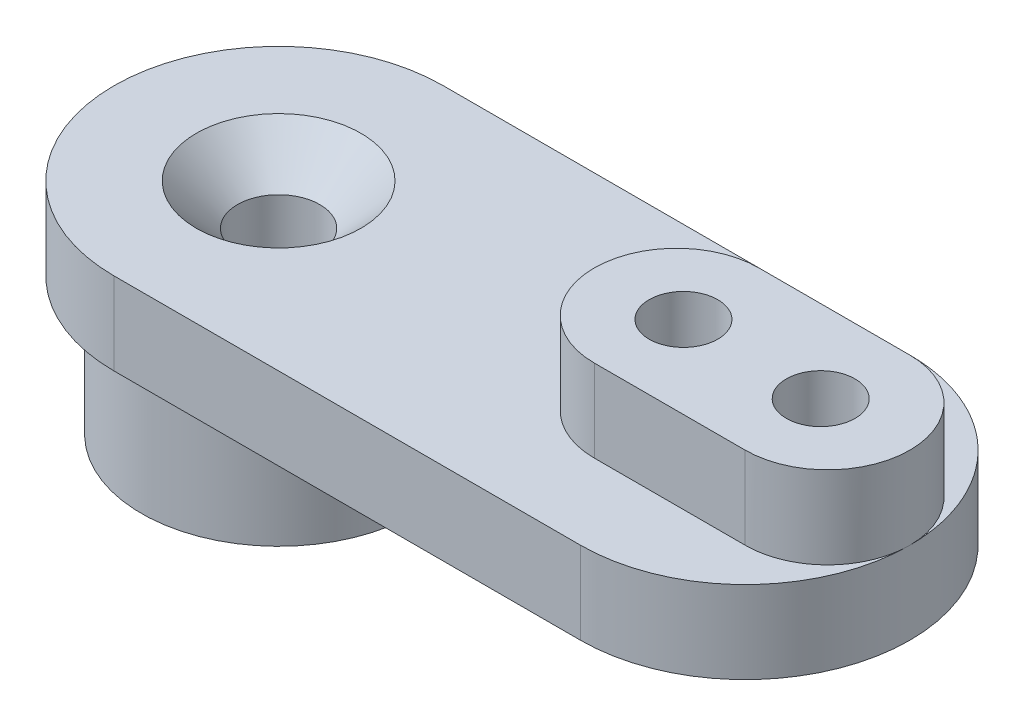
ISO-10303-21;
HEADER;
FILE_DESCRIPTION(('STEP AP214'),'2;1');
FILE_NAME('part.step','',(''),(''),'','','');
FILE_SCHEMA(('AUTOMOTIVE_DESIGN { 1 0 10303 214 1 1 1 1 }'));
ENDSEC;
DATA;
#1=APPLICATION_CONTEXT('core data for automotive mechanical design processes');
#2=APPLICATION_PROTOCOL_DEFINITION('international standard','automotive_design',2000,#1);
#3=PRODUCT_CONTEXT('',#1,'mechanical');
#4=PRODUCT('Part','Part','',(#3));
#5=PRODUCT_RELATED_PRODUCT_CATEGORY('part','',(#4));
#6=PRODUCT_DEFINITION_FORMATION('','',#4);
#7=PRODUCT_DEFINITION_CONTEXT('part definition',#1,'design');
#8=PRODUCT_DEFINITION('design','',#6,#7);
#9=PRODUCT_DEFINITION_SHAPE('','',#8);
#10=(LENGTH_UNIT() NAMED_UNIT(*) SI_UNIT(.MILLI.,.METRE.));
#11=(NAMED_UNIT(*) PLANE_ANGLE_UNIT() SI_UNIT($,.RADIAN.));
#12=(NAMED_UNIT(*) SI_UNIT($,.STERADIAN.) SOLID_ANGLE_UNIT());
#13=UNCERTAINTY_MEASURE_WITH_UNIT(LENGTH_MEASURE(1.E-05),#10,'distance_accuracy_value','');
#14=(GEOMETRIC_REPRESENTATION_CONTEXT(3) GLOBAL_UNCERTAINTY_ASSIGNED_CONTEXT((#13)) GLOBAL_UNIT_ASSIGNED_CONTEXT((#10,
#11,#12)) REPRESENTATION_CONTEXT('',''));
#15=CARTESIAN_POINT('',(0.,0.,0.));
#16=DIRECTION('',(0.,0.,1.));
#17=DIRECTION('',(1.,0.,0.));
#18=AXIS2_PLACEMENT_3D('',#15,#16,#17);
#19=CARTESIAN_POINT('',(-8.5,3.,0.));
#20=DIRECTION('',(0.,1.,0.));
#21=DIRECTION('',(0.,0.,1.));
#22=AXIS2_PLACEMENT_3D('',#19,#20,#21);
#23=PLANE('',#22);
#24=CARTESIAN_POINT('',(-8.5,3.,0.));
#25=DIRECTION('',(0.,1.,0.));
#26=DIRECTION('',(0.,0.,1.));
#27=AXIS2_PLACEMENT_3D('',#24,#25,#26);
#28=CIRCLE('',#27,3.);
#29=CARTESIAN_POINT('',(-8.5,3.,3.));
#30=VERTEX_POINT('',#29);
#31=EDGE_CURVE('E11',#30,#30,#28,.F.);
#32=ORIENTED_EDGE('',*,*,#31,.T.);
#33=EDGE_LOOP('',(#32));
#34=FACE_BOUND('',#33,.T.);
#35=DIRECTION('',(-1.,0.,0.));
#36=VECTOR('',#35,1.);
#37=CARTESIAN_POINT('',(6.,3.,-3.));
#38=LINE('',#37,#36);
#39=CARTESIAN_POINT('',(11.5,3.,-3.));
#40=VERTEX_POINT('',#39);
#41=CARTESIAN_POINT('',(6.,3.,-3.));
#42=VERTEX_POINT('',#41);
#43=EDGE_CURVE('E47',#40,#42,#38,.T.);
#44=ORIENTED_EDGE('',*,*,#43,.F.);
#45=CARTESIAN_POINT('',(11.5,3.,0.));
#46=DIRECTION('',(0.,1.,0.));
#47=DIRECTION('',(0.,0.,1.));
#48=AXIS2_PLACEMENT_3D('',#45,#46,#47);
#49=CIRCLE('',#48,3.);
#50=CARTESIAN_POINT('',(14.5,3.,0.));
#51=VERTEX_POINT('',#50);
#52=EDGE_CURVE('E164',#51,#40,#49,.T.);
#53=ORIENTED_EDGE('',*,*,#52,.F.);
#54=CARTESIAN_POINT('',(8.5,3.,0.));
#55=DIRECTION('',(0.,1.,0.));
#56=DIRECTION('',(0.,0.,1.));
#57=AXIS2_PLACEMENT_3D('',#54,#55,#56);
#58=CIRCLE('',#57,6.);
#59=CARTESIAN_POINT('',(8.5,3.,-6.));
#60=VERTEX_POINT('',#59);
#61=EDGE_CURVE('E139',#51,#60,#58,.T.);
#62=ORIENTED_EDGE('',*,*,#61,.T.);
#63=DIRECTION('',(-1.,0.,0.));
#64=VECTOR('',#63,1.);
#65=CARTESIAN_POINT('',(-8.5,3.,-6.));
#66=LINE('',#65,#64);
#67=CARTESIAN_POINT('',(-8.5,3.,-6.));
#68=VERTEX_POINT('',#67);
#69=EDGE_CURVE('E143',#60,#68,#66,.T.);
#70=ORIENTED_EDGE('',*,*,#69,.T.);
#71=CARTESIAN_POINT('',(-8.5,3.,0.));
#72=DIRECTION('',(0.,1.,0.));
#73=DIRECTION('',(0.,0.,1.));
#74=AXIS2_PLACEMENT_3D('',#71,#72,#73);
#75=CIRCLE('',#74,6.);
#76=CARTESIAN_POINT('',(-8.5,3.,6.));
#77=VERTEX_POINT('',#76);
#78=EDGE_CURVE('E133',#68,#77,#75,.T.);
#79=ORIENTED_EDGE('',*,*,#78,.T.);
#80=DIRECTION('',(1.,0.,0.));
#81=VECTOR('',#80,1.);
#82=CARTESIAN_POINT('',(-8.5,3.,6.));
#83=LINE('',#82,#81);
#84=CARTESIAN_POINT('',(8.5,3.,6.));
#85=VERTEX_POINT('',#84);
#86=EDGE_CURVE('E136',#77,#85,#83,.T.);
#87=ORIENTED_EDGE('',*,*,#86,.T.);
#88=EDGE_CURVE('E140',#85,#51,#58,.T.);
#89=ORIENTED_EDGE('',*,*,#88,.T.);
#90=CARTESIAN_POINT('',(11.5,3.,3.));
#91=VERTEX_POINT('',#90);
#92=EDGE_CURVE('E226',#91,#51,#49,.T.);
#93=ORIENTED_EDGE('',*,*,#92,.F.);
#94=DIRECTION('',(1.,0.,0.));
#95=VECTOR('',#94,1.);
#96=CARTESIAN_POINT('',(6.,3.,3.));
#97=LINE('',#96,#95);
#98=CARTESIAN_POINT('',(6.,3.,3.));
#99=VERTEX_POINT('',#98);
#100=EDGE_CURVE('E231',#99,#91,#97,.T.);
#101=ORIENTED_EDGE('',*,*,#100,.F.);
#102=CARTESIAN_POINT('',(6.,3.,0.));
#103=DIRECTION('',(0.,1.,0.));
#104=DIRECTION('',(0.,0.,1.));
#105=AXIS2_PLACEMENT_3D('',#102,#103,#104);
#106=CIRCLE('',#105,3.);
#107=EDGE_CURVE('E52',#42,#99,#106,.T.);
#108=ORIENTED_EDGE('',*,*,#107,.F.);
#109=EDGE_LOOP('',(#44,#53,#62,#70,#79,#87,#89,#93,#101,#108));
#110=FACE_BOUND('',#109,.T.);
#111=ADVANCED_FACE('F32',(#34,#110),#23,.T.);
#112=CARTESIAN_POINT('',(-8.5,0.,0.));
#113=DIRECTION('',(0.,1.,0.));
#114=DIRECTION('',(0.,0.,1.));
#115=AXIS2_PLACEMENT_3D('',#112,#113,#114);
#116=PLANE('',#115);
#117=CARTESIAN_POINT('',(-8.5,0.,0.));
#118=DIRECTION('',(0.,-1.,0.));
#119=DIRECTION('',(0.,0.,-1.));
#120=AXIS2_PLACEMENT_3D('',#117,#118,#119);
#121=CIRCLE('',#120,5.);
#122=CARTESIAN_POINT('',(-8.5,0.,-5.));
#123=VERTEX_POINT('',#122);
#124=EDGE_CURVE('E167',#123,#123,#121,.T.);
#125=ORIENTED_EDGE('',*,*,#124,.F.);
#126=EDGE_LOOP('',(#125));
#127=FACE_BOUND('',#126,.T.);
#128=CARTESIAN_POINT('',(-8.5,0.,0.));
#129=DIRECTION('',(0.,1.,0.));
#130=DIRECTION('',(0.,0.,1.));
#131=AXIS2_PLACEMENT_3D('',#128,#129,#130);
#132=CIRCLE('',#131,6.);
#133=CARTESIAN_POINT('',(-8.5,0.,-6.));
#134=VERTEX_POINT('',#133);
#135=CARTESIAN_POINT('',(-8.5,0.,6.));
#136=VERTEX_POINT('',#135);
#137=EDGE_CURVE('E132',#134,#136,#132,.T.);
#138=ORIENTED_EDGE('',*,*,#137,.F.);
#139=DIRECTION('',(-1.,0.,0.));
#140=VECTOR('',#139,1.);
#141=CARTESIAN_POINT('',(-8.5,0.,-6.));
#142=LINE('',#141,#140);
#143=CARTESIAN_POINT('',(8.5,0.,-6.));
#144=VERTEX_POINT('',#143);
#145=EDGE_CURVE('E137',#144,#134,#142,.T.);
#146=ORIENTED_EDGE('',*,*,#145,.F.);
#147=CARTESIAN_POINT('',(8.5,0.,0.));
#148=DIRECTION('',(0.,1.,0.));
#149=DIRECTION('',(0.,0.,1.));
#150=AXIS2_PLACEMENT_3D('',#147,#148,#149);
#151=CIRCLE('',#150,6.);
#152=CARTESIAN_POINT('',(8.5,0.,6.));
#153=VERTEX_POINT('',#152);
#154=EDGE_CURVE('E150',#153,#144,#151,.T.);
#155=ORIENTED_EDGE('',*,*,#154,.F.);
#156=DIRECTION('',(1.,0.,0.));
#157=VECTOR('',#156,1.);
#158=CARTESIAN_POINT('',(-8.5,0.,6.));
#159=LINE('',#158,#157);
#160=EDGE_CURVE('E148',#136,#153,#159,.T.);
#161=ORIENTED_EDGE('',*,*,#160,.F.);
#162=EDGE_LOOP('',(#138,#146,#155,#161));
#163=FACE_BOUND('',#162,.T.);
#164=CARTESIAN_POINT('',(11.25,0.,0.));
#165=DIRECTION('',(0.,1.,0.));
#166=DIRECTION('',(0.,0.,1.));
#167=AXIS2_PLACEMENT_3D('',#164,#165,#166);
#168=CIRCLE('',#167,1.25);
#169=CARTESIAN_POINT('',(11.25,0.,1.25));
#170=VERTEX_POINT('',#169);
#171=EDGE_CURVE('E124',#170,#170,#168,.T.);
#172=ORIENTED_EDGE('',*,*,#171,.T.);
#173=EDGE_LOOP('',(#172));
#174=FACE_BOUND('',#173,.T.);
#175=CARTESIAN_POINT('',(6.25,0.,0.));
#176=DIRECTION('',(0.,1.,0.));
#177=DIRECTION('',(0.,0.,1.));
#178=AXIS2_PLACEMENT_3D('',#175,#176,#177);
#179=CIRCLE('',#178,1.25);
#180=CARTESIAN_POINT('',(6.25,0.,1.25));
#181=VERTEX_POINT('',#180);
#182=EDGE_CURVE('E121',#181,#181,#179,.T.);
#183=ORIENTED_EDGE('',*,*,#182,.T.);
#184=EDGE_LOOP('',(#183));
#185=FACE_BOUND('',#184,.T.);
#186=ADVANCED_FACE('F185',(#127,#163,#174,#185),#116,.F.);
#187=CARTESIAN_POINT('',(-8.5,3.,0.));
#188=DIRECTION('',(0.,-1.,0.));
#189=DIRECTION('',(0.,0.,-1.));
#190=AXIS2_PLACEMENT_3D('',#187,#188,#189);
#191=CYLINDRICAL_SURFACE('',#190,6.);
#192=ORIENTED_EDGE('',*,*,#137,.T.);
#193=DIRECTION('',(0.,-1.,0.));
#194=VECTOR('',#193,1.);
#195=CARTESIAN_POINT('',(-8.5,3.,6.));
#196=LINE('',#195,#194);
#197=EDGE_CURVE('E161',#77,#136,#196,.T.);
#198=ORIENTED_EDGE('',*,*,#197,.F.);
#199=ORIENTED_EDGE('',*,*,#78,.F.);
#200=DIRECTION('',(0.,-1.,0.));
#201=VECTOR('',#200,1.);
#202=CARTESIAN_POINT('',(-8.5,3.,-6.));
#203=LINE('',#202,#201);
#204=EDGE_CURVE('E145',#68,#134,#203,.T.);
#205=ORIENTED_EDGE('',*,*,#204,.T.);
#206=EDGE_LOOP('',(#192,#198,#199,#205));
#207=FACE_BOUND('',#206,.T.);
#208=ADVANCED_FACE('F191',(#207),#191,.T.);
#209=CARTESIAN_POINT('',(-8.5,3.,6.));
#210=DIRECTION('',(0.,0.,-1.));
#211=DIRECTION('',(-1.,0.,0.));
#212=AXIS2_PLACEMENT_3D('',#209,#210,#211);
#213=PLANE('',#212);
#214=ORIENTED_EDGE('',*,*,#160,.T.);
#215=DIRECTION('',(0.,-1.,0.));
#216=VECTOR('',#215,1.);
#217=CARTESIAN_POINT('',(8.5,3.,6.));
#218=LINE('',#217,#216);
#219=EDGE_CURVE('E158',#85,#153,#218,.T.);
#220=ORIENTED_EDGE('',*,*,#219,.F.);
#221=ORIENTED_EDGE('',*,*,#86,.F.);
#222=ORIENTED_EDGE('',*,*,#197,.T.);
#223=EDGE_LOOP('',(#214,#220,#221,#222));
#224=FACE_BOUND('',#223,.T.);
#225=ADVANCED_FACE('F204',(#224),#213,.F.);
#226=CARTESIAN_POINT('',(8.5,3.,0.));
#227=DIRECTION('',(0.,-1.,0.));
#228=DIRECTION('',(0.,0.,-1.));
#229=AXIS2_PLACEMENT_3D('',#226,#227,#228);
#230=CYLINDRICAL_SURFACE('',#229,6.);
#231=ORIENTED_EDGE('',*,*,#154,.T.);
#232=DIRECTION('',(0.,-1.,0.));
#233=VECTOR('',#232,1.);
#234=CARTESIAN_POINT('',(8.5,3.,-6.));
#235=LINE('',#234,#233);
#236=EDGE_CURVE('E155',#60,#144,#235,.T.);
#237=ORIENTED_EDGE('',*,*,#236,.F.);
#238=ORIENTED_EDGE('',*,*,#61,.F.);
#239=ORIENTED_EDGE('',*,*,#88,.F.);
#240=ORIENTED_EDGE('',*,*,#219,.T.);
#241=EDGE_LOOP('',(#231,#237,#238,#239,#240));
#242=FACE_BOUND('',#241,.T.);
#243=ADVANCED_FACE('F200',(#242),#230,.T.);
#244=CARTESIAN_POINT('',(-8.5,3.,-6.));
#245=DIRECTION('',(0.,0.,1.));
#246=DIRECTION('',(1.,0.,0.));
#247=AXIS2_PLACEMENT_3D('',#244,#245,#246);
#248=PLANE('',#247);
#249=ORIENTED_EDGE('',*,*,#145,.T.);
#250=ORIENTED_EDGE('',*,*,#204,.F.);
#251=ORIENTED_EDGE('',*,*,#69,.F.);
#252=ORIENTED_EDGE('',*,*,#236,.T.);
#253=EDGE_LOOP('',(#249,#250,#251,#252));
#254=FACE_BOUND('',#253,.T.);
#255=ADVANCED_FACE('F197',(#254),#248,.F.);
#256=CARTESIAN_POINT('',(-8.5,3.,0.));
#257=DIRECTION('',(0.,-1.,0.));
#258=DIRECTION('',(0.,0.,-1.));
#259=AXIS2_PLACEMENT_3D('',#256,#257,#258);
#260=CYLINDRICAL_SURFACE('',#259,1.5);
#261=CARTESIAN_POINT('',(-8.5,1.5,0.));
#262=DIRECTION('',(0.,1.,0.));
#263=DIRECTION('',(0.,0.,1.));
#264=AXIS2_PLACEMENT_3D('',#261,#262,#263);
#265=CIRCLE('',#264,1.5);
#266=CARTESIAN_POINT('',(-8.5,1.5,1.5));
#267=VERTEX_POINT('',#266);
#268=EDGE_CURVE('E40',#267,#267,#265,.T.);
#269=ORIENTED_EDGE('',*,*,#268,.T.);
#270=EDGE_LOOP('',(#269));
#271=FACE_BOUND('',#270,.T.);
#272=CARTESIAN_POINT('',(-8.5,-1.,0.));
#273=DIRECTION('',(0.,-1.,0.));
#274=DIRECTION('',(0.,0.,-1.));
#275=AXIS2_PLACEMENT_3D('',#272,#273,#274);
#276=CIRCLE('',#275,1.5);
#277=CARTESIAN_POINT('',(-8.5,-1.,-1.5));
#278=VERTEX_POINT('',#277);
#279=EDGE_CURVE('E413',#278,#278,#276,.F.);
#280=ORIENTED_EDGE('',*,*,#279,.F.);
#281=EDGE_LOOP('',(#280));
#282=FACE_BOUND('',#281,.T.);
#283=ADVANCED_FACE('F171',(#271,#282),#260,.F.);
#284=CARTESIAN_POINT('',(11.25,3.,0.));
#285=DIRECTION('',(0.,-1.,0.));
#286=DIRECTION('',(0.,0.,-1.));
#287=AXIS2_PLACEMENT_3D('',#284,#285,#286);
#288=CYLINDRICAL_SURFACE('',#287,1.25);
#289=ORIENTED_EDGE('',*,*,#171,.F.);
#290=EDGE_LOOP('',(#289));
#291=FACE_BOUND('',#290,.T.);
#292=CARTESIAN_POINT('',(11.25,6.,0.));
#293=DIRECTION('',(0.,1.,0.));
#294=DIRECTION('',(0.,0.,1.));
#295=AXIS2_PLACEMENT_3D('',#292,#293,#294);
#296=CIRCLE('',#295,1.25);
#297=CARTESIAN_POINT('',(11.25,6.,1.25));
#298=VERTEX_POINT('',#297);
#299=EDGE_CURVE('E243',#298,#298,#296,.T.);
#300=ORIENTED_EDGE('',*,*,#299,.T.);
#301=EDGE_LOOP('',(#300));
#302=FACE_BOUND('',#301,.T.);
#303=ADVANCED_FACE('F275',(#291,#302),#288,.F.);
#304=CARTESIAN_POINT('',(6.25,3.,0.));
#305=DIRECTION('',(0.,-1.,0.));
#306=DIRECTION('',(0.,0.,-1.));
#307=AXIS2_PLACEMENT_3D('',#304,#305,#306);
#308=CYLINDRICAL_SURFACE('',#307,1.25);
#309=ORIENTED_EDGE('',*,*,#182,.F.);
#310=EDGE_LOOP('',(#309));
#311=FACE_BOUND('',#310,.T.);
#312=CARTESIAN_POINT('',(6.25,6.,0.));
#313=DIRECTION('',(0.,1.,0.));
#314=DIRECTION('',(0.,0.,1.));
#315=AXIS2_PLACEMENT_3D('',#312,#313,#314);
#316=CIRCLE('',#315,1.25);
#317=CARTESIAN_POINT('',(6.25,6.,1.25));
#318=VERTEX_POINT('',#317);
#319=EDGE_CURVE('E246',#318,#318,#316,.T.);
#320=ORIENTED_EDGE('',*,*,#319,.T.);
#321=EDGE_LOOP('',(#320));
#322=FACE_BOUND('',#321,.T.);
#323=ADVANCED_FACE('F273',(#311,#322),#308,.F.);
#324=CARTESIAN_POINT('',(6.,6.,0.));
#325=DIRECTION('',(0.,1.,0.));
#326=DIRECTION('',(0.,0.,1.));
#327=AXIS2_PLACEMENT_3D('',#324,#325,#326);
#328=PLANE('',#327);
#329=ORIENTED_EDGE('',*,*,#319,.F.);
#330=EDGE_LOOP('',(#329));
#331=FACE_BOUND('',#330,.T.);
#332=CARTESIAN_POINT('',(6.,6.,0.));
#333=DIRECTION('',(0.,1.,0.));
#334=DIRECTION('',(0.,0.,1.));
#335=AXIS2_PLACEMENT_3D('',#332,#333,#334);
#336=CIRCLE('',#335,3.);
#337=CARTESIAN_POINT('',(6.,6.,-3.));
#338=VERTEX_POINT('',#337);
#339=CARTESIAN_POINT('',(6.,6.,3.));
#340=VERTEX_POINT('',#339);
#341=EDGE_CURVE('E109',#338,#340,#336,.T.);
#342=ORIENTED_EDGE('',*,*,#341,.T.);
#343=DIRECTION('',(1.,0.,0.));
#344=VECTOR('',#343,1.);
#345=CARTESIAN_POINT('',(6.,6.,3.));
#346=LINE('',#345,#344);
#347=CARTESIAN_POINT('',(11.5,6.,3.));
#348=VERTEX_POINT('',#347);
#349=EDGE_CURVE('E98',#340,#348,#346,.T.);
#350=ORIENTED_EDGE('',*,*,#349,.T.);
#351=CARTESIAN_POINT('',(11.5,6.,0.));
#352=DIRECTION('',(0.,1.,0.));
#353=DIRECTION('',(0.,0.,1.));
#354=AXIS2_PLACEMENT_3D('',#351,#352,#353);
#355=CIRCLE('',#354,3.);
#356=CARTESIAN_POINT('',(11.5,6.,-3.));
#357=VERTEX_POINT('',#356);
#358=EDGE_CURVE('E108',#348,#357,#355,.T.);
#359=ORIENTED_EDGE('',*,*,#358,.T.);
#360=DIRECTION('',(-1.,0.,0.));
#361=VECTOR('',#360,1.);
#362=CARTESIAN_POINT('',(6.,6.,-3.));
#363=LINE('',#362,#361);
#364=EDGE_CURVE('E115',#357,#338,#363,.T.);
#365=ORIENTED_EDGE('',*,*,#364,.T.);
#366=EDGE_LOOP('',(#342,#350,#359,#365));
#367=FACE_BOUND('',#366,.T.);
#368=ORIENTED_EDGE('',*,*,#299,.F.);
#369=EDGE_LOOP('',(#368));
#370=FACE_BOUND('',#369,.T.);
#371=ADVANCED_FACE('F112',(#331,#367,#370),#328,.T.);
#372=CARTESIAN_POINT('',(6.,6.,0.));
#373=DIRECTION('',(0.,-1.,0.));
#374=DIRECTION('',(0.,0.,-1.));
#375=AXIS2_PLACEMENT_3D('',#372,#373,#374);
#376=CYLINDRICAL_SURFACE('',#375,3.);
#377=ORIENTED_EDGE('',*,*,#107,.T.);
#378=DIRECTION('',(0.,-1.,0.));
#379=VECTOR('',#378,1.);
#380=CARTESIAN_POINT('',(6.,6.,3.));
#381=LINE('',#380,#379);
#382=EDGE_CURVE('E103',#340,#99,#381,.T.);
#383=ORIENTED_EDGE('',*,*,#382,.F.);
#384=ORIENTED_EDGE('',*,*,#341,.F.);
#385=DIRECTION('',(0.,-1.,0.));
#386=VECTOR('',#385,1.);
#387=CARTESIAN_POINT('',(6.,6.,-3.));
#388=LINE('',#387,#386);
#389=EDGE_CURVE('E251',#338,#42,#388,.T.);
#390=ORIENTED_EDGE('',*,*,#389,.T.);
#391=EDGE_LOOP('',(#377,#383,#384,#390));
#392=FACE_BOUND('',#391,.T.);
#393=ADVANCED_FACE('F120',(#392),#376,.T.);
#394=CARTESIAN_POINT('',(6.,6.,3.));
#395=DIRECTION('',(0.,0.,-1.));
#396=DIRECTION('',(-1.,0.,0.));
#397=AXIS2_PLACEMENT_3D('',#394,#395,#396);
#398=PLANE('',#397);
#399=ORIENTED_EDGE('',*,*,#100,.T.);
#400=DIRECTION('',(0.,-1.,0.));
#401=VECTOR('',#400,1.);
#402=CARTESIAN_POINT('',(11.5,6.,3.));
#403=LINE('',#402,#401);
#404=EDGE_CURVE('E105',#348,#91,#403,.T.);
#405=ORIENTED_EDGE('',*,*,#404,.F.);
#406=ORIENTED_EDGE('',*,*,#349,.F.);
#407=ORIENTED_EDGE('',*,*,#382,.T.);
#408=EDGE_LOOP('',(#399,#405,#406,#407));
#409=FACE_BOUND('',#408,.T.);
#410=ADVANCED_FACE('F101',(#409),#398,.F.);
#411=CARTESIAN_POINT('',(11.5,6.,0.));
#412=DIRECTION('',(0.,-1.,0.));
#413=DIRECTION('',(0.,0.,-1.));
#414=AXIS2_PLACEMENT_3D('',#411,#412,#413);
#415=CYLINDRICAL_SURFACE('',#414,3.);
#416=ORIENTED_EDGE('',*,*,#92,.T.);
#417=ORIENTED_EDGE('',*,*,#52,.T.);
#418=DIRECTION('',(0.,-1.,0.));
#419=VECTOR('',#418,1.);
#420=CARTESIAN_POINT('',(11.5,6.,-3.));
#421=LINE('',#420,#419);
#422=EDGE_CURVE('E126',#357,#40,#421,.T.);
#423=ORIENTED_EDGE('',*,*,#422,.F.);
#424=ORIENTED_EDGE('',*,*,#358,.F.);
#425=ORIENTED_EDGE('',*,*,#404,.T.);
#426=EDGE_LOOP('',(#416,#417,#423,#424,#425));
#427=FACE_BOUND('',#426,.T.);
#428=ADVANCED_FACE('F228',(#427),#415,.T.);
#429=CARTESIAN_POINT('',(6.,6.,-3.));
#430=DIRECTION('',(0.,0.,1.));
#431=DIRECTION('',(1.,0.,0.));
#432=AXIS2_PLACEMENT_3D('',#429,#430,#431);
#433=PLANE('',#432);
#434=ORIENTED_EDGE('',*,*,#43,.T.);
#435=ORIENTED_EDGE('',*,*,#389,.F.);
#436=ORIENTED_EDGE('',*,*,#364,.F.);
#437=ORIENTED_EDGE('',*,*,#422,.T.);
#438=EDGE_LOOP('',(#434,#435,#436,#437));
#439=FACE_BOUND('',#438,.T.);
#440=ADVANCED_FACE('F254',(#439),#433,.F.);
#441=CARTESIAN_POINT('',(-8.5,-5.,0.));
#442=DIRECTION('',(0.,-1.,0.));
#443=DIRECTION('',(0.,0.,-1.));
#444=AXIS2_PLACEMENT_3D('',#441,#442,#443);
#445=PLANE('',#444);
#446=CARTESIAN_POINT('',(-8.5,-5.,0.));
#447=DIRECTION('',(0.,-1.,0.));
#448=DIRECTION('',(0.,0.,-1.));
#449=AXIS2_PLACEMENT_3D('',#446,#447,#448);
#450=CIRCLE('',#449,5.);
#451=CARTESIAN_POINT('',(-8.5,-5.,-5.));
#452=VERTEX_POINT('',#451);
#453=EDGE_CURVE('E241',#452,#452,#450,.T.);
#454=ORIENTED_EDGE('',*,*,#453,.T.);
#455=EDGE_LOOP('',(#454));
#456=FACE_BOUND('',#455,.T.);
#457=CARTESIAN_POINT('',(-8.5,-5.,0.));
#458=DIRECTION('',(0.,-1.,0.));
#459=DIRECTION('',(0.,0.,-1.));
#460=AXIS2_PLACEMENT_3D('',#457,#458,#459);
#461=CIRCLE('',#460,3.);
#462=CARTESIAN_POINT('',(-8.5,-5.,-3.));
#463=VERTEX_POINT('',#462);
#464=EDGE_CURVE('E411',#463,#463,#461,.T.);
#465=ORIENTED_EDGE('',*,*,#464,.F.);
#466=EDGE_LOOP('',(#465));
#467=FACE_BOUND('',#466,.T.);
#468=ADVANCED_FACE('F256',(#456,#467),#445,.T.);
#469=CARTESIAN_POINT('',(-8.5,-5.,0.));
#470=DIRECTION('',(0.,1.,0.));
#471=DIRECTION('',(0.,0.,1.));
#472=AXIS2_PLACEMENT_3D('',#469,#470,#471);
#473=CYLINDRICAL_SURFACE('',#472,5.);
#474=ORIENTED_EDGE('',*,*,#453,.F.);
#475=EDGE_LOOP('',(#474));
#476=FACE_BOUND('',#475,.T.);
#477=ORIENTED_EDGE('',*,*,#124,.T.);
#478=EDGE_LOOP('',(#477));
#479=FACE_BOUND('',#478,.T.);
#480=ADVANCED_FACE('F262',(#476,#479),#473,.T.);
#481=CARTESIAN_POINT('',(-8.5,-5.,0.));
#482=DIRECTION('',(0.,1.,0.));
#483=DIRECTION('',(0.,0.,1.));
#484=AXIS2_PLACEMENT_3D('',#481,#482,#483);
#485=CYLINDRICAL_SURFACE('',#484,3.);
#486=CARTESIAN_POINT('',(-8.5,-1.,0.));
#487=DIRECTION('',(0.,-1.,0.));
#488=DIRECTION('',(0.,0.,-1.));
#489=AXIS2_PLACEMENT_3D('',#486,#487,#488);
#490=CIRCLE('',#489,3.);
#491=CARTESIAN_POINT('',(-8.5,-1.,-3.));
#492=VERTEX_POINT('',#491);
#493=EDGE_CURVE('E165',#492,#492,#490,.T.);
#494=ORIENTED_EDGE('',*,*,#493,.F.);
#495=EDGE_LOOP('',(#494));
#496=FACE_BOUND('',#495,.T.);
#497=ORIENTED_EDGE('',*,*,#464,.T.);
#498=EDGE_LOOP('',(#497));
#499=FACE_BOUND('',#498,.T.);
#500=ADVANCED_FACE('F180',(#496,#499),#485,.F.);
#501=CARTESIAN_POINT('',(0.,-1.,0.));
#502=DIRECTION('',(0.,-1.,0.));
#503=DIRECTION('',(0.,0.,-1.));
#504=AXIS2_PLACEMENT_3D('',#501,#502,#503);
#505=PLANE('',#504);
#506=ORIENTED_EDGE('',*,*,#279,.T.);
#507=EDGE_LOOP('',(#506));
#508=FACE_BOUND('',#507,.T.);
#509=ORIENTED_EDGE('',*,*,#493,.T.);
#510=EDGE_LOOP('',(#509));
#511=FACE_BOUND('',#510,.T.);
#512=ADVANCED_FACE('F175',(#508,#511),#505,.T.);
#513=CARTESIAN_POINT('',(-8.5,1.5,0.));
#514=DIRECTION('',(0.,1.,0.));
#515=DIRECTION('',(0.,0.,1.));
#516=AXIS2_PLACEMENT_3D('',#513,#514,#515);
#517=CONICAL_SURFACE('',#516,1.5,0.785398163397449);
#518=ORIENTED_EDGE('',*,*,#31,.F.);
#519=EDGE_LOOP('',(#518));
#520=FACE_BOUND('',#519,.T.);
#521=ORIENTED_EDGE('',*,*,#268,.F.);
#522=EDGE_LOOP('',(#521));
#523=FACE_BOUND('',#522,.T.);
#524=ADVANCED_FACE('F34',(#520,#523),#517,.F.);
#525=CLOSED_SHELL('',(#111,#186,#208,#225,#243,#255,#283,#303,#323,#371,#393,#410,#428,#440,
#468,#480,#500,#512,#524));
#526=MANIFOLD_SOLID_BREP('B2',#525);
#527=ADVANCED_BREP_SHAPE_REPRESENTATION('',(#18,#526),#14);
#528=SHAPE_DEFINITION_REPRESENTATION(#9,#527);
ENDSEC;
END-ISO-10303-21;
